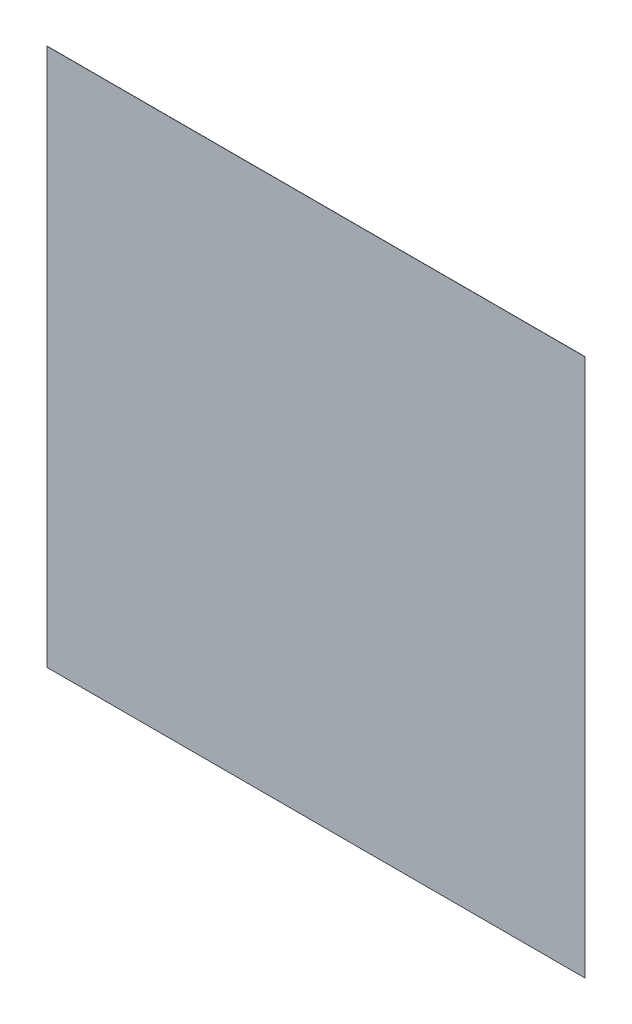
ISO-10303-21;
HEADER;
FILE_DESCRIPTION(('STEP AP214'),'2;1');
FILE_NAME('part.step','',(''),(''),'','','');
FILE_SCHEMA(('AUTOMOTIVE_DESIGN { 1 0 10303 214 1 1 1 1 }'));
ENDSEC;
DATA;
#1=APPLICATION_CONTEXT('core data for automotive mechanical design processes');
#2=APPLICATION_PROTOCOL_DEFINITION('international standard','automotive_design',2000,#1);
#3=PRODUCT_CONTEXT('',#1,'mechanical');
#4=PRODUCT('Part','Part','',(#3));
#5=PRODUCT_RELATED_PRODUCT_CATEGORY('part','',(#4));
#6=PRODUCT_DEFINITION_FORMATION('','',#4);
#7=PRODUCT_DEFINITION_CONTEXT('part definition',#1,'design');
#8=PRODUCT_DEFINITION('design','',#6,#7);
#9=PRODUCT_DEFINITION_SHAPE('','',#8);
#10=(LENGTH_UNIT() NAMED_UNIT(*) SI_UNIT(.MILLI.,.METRE.));
#11=(NAMED_UNIT(*) PLANE_ANGLE_UNIT() SI_UNIT($,.RADIAN.));
#12=(NAMED_UNIT(*) SI_UNIT($,.STERADIAN.) SOLID_ANGLE_UNIT());
#13=UNCERTAINTY_MEASURE_WITH_UNIT(LENGTH_MEASURE(1.E-05),#10,'distance_accuracy_value','');
#14=(GEOMETRIC_REPRESENTATION_CONTEXT(3) GLOBAL_UNCERTAINTY_ASSIGNED_CONTEXT((#13)) GLOBAL_UNIT_ASSIGNED_CONTEXT((#10,
#11,#12)) REPRESENTATION_CONTEXT('',''));
#15=CARTESIAN_POINT('',(0.,0.,0.));
#16=DIRECTION('',(0.,0.,1.));
#17=DIRECTION('',(1.,0.,0.));
#18=AXIS2_PLACEMENT_3D('',#15,#16,#17);
#19=CARTESIAN_POINT('',(-152.4,152.4,-0.1));
#20=DIRECTION('',(-1.,0.,0.));
#21=DIRECTION('',(0.,0.,1.));
#22=AXIS2_PLACEMENT_3D('',#19,#20,#21);
#23=PLANE('',#22);
#24=DIRECTION('',(0.,-1.,0.));
#25=VECTOR('',#24,1.);
#26=CARTESIAN_POINT('',(-152.4,152.4,0.));
#27=LINE('',#26,#25);
#28=CARTESIAN_POINT('',(-152.4,152.4,0.));
#29=VERTEX_POINT('',#28);
#30=CARTESIAN_POINT('',(-152.4,-152.4,0.));
#31=VERTEX_POINT('',#30);
#32=EDGE_CURVE('E95',#29,#31,#27,.T.);
#33=ORIENTED_EDGE('',*,*,#32,.F.);
#34=DIRECTION('',(0.,0.,1.));
#35=VECTOR('',#34,1.);
#36=CARTESIAN_POINT('',(-152.4,152.4,-0.1));
#37=LINE('',#36,#35);
#38=CARTESIAN_POINT('',(-152.4,152.4,-0.1));
#39=VERTEX_POINT('',#38);
#40=EDGE_CURVE('E11',#39,#29,#37,.T.);
#41=ORIENTED_EDGE('',*,*,#40,.F.);
#42=DIRECTION('',(0.,-1.,0.));
#43=VECTOR('',#42,1.);
#44=CARTESIAN_POINT('',(-152.4,152.4,-0.1));
#45=LINE('',#44,#43);
#46=CARTESIAN_POINT('',(-152.4,-152.4,-0.1));
#47=VERTEX_POINT('',#46);
#48=EDGE_CURVE('E89',#39,#47,#45,.T.);
#49=ORIENTED_EDGE('',*,*,#48,.T.);
#50=DIRECTION('',(0.,0.,1.));
#51=VECTOR('',#50,1.);
#52=CARTESIAN_POINT('',(-152.4,-152.4,-0.1));
#53=LINE('',#52,#51);
#54=EDGE_CURVE('E34',#47,#31,#53,.T.);
#55=ORIENTED_EDGE('',*,*,#54,.T.);
#56=EDGE_LOOP('',(#33,#41,#49,#55));
#57=FACE_BOUND('',#56,.T.);
#58=ADVANCED_FACE('F31',(#57),#23,.T.);
#59=CARTESIAN_POINT('',(-152.4,152.4,-0.1));
#60=DIRECTION('',(0.,1.,0.));
#61=DIRECTION('',(-1.,0.,0.));
#62=AXIS2_PLACEMENT_3D('',#59,#60,#61);
#63=PLANE('',#62);
#64=DIRECTION('',(-1.,0.,0.));
#65=VECTOR('',#64,1.);
#66=CARTESIAN_POINT('',(-152.4,152.4,0.));
#67=LINE('',#66,#65);
#68=CARTESIAN_POINT('',(152.4,152.4,0.));
#69=VERTEX_POINT('',#68);
#70=EDGE_CURVE('E91',#69,#29,#67,.T.);
#71=ORIENTED_EDGE('',*,*,#70,.F.);
#72=DIRECTION('',(0.,0.,1.));
#73=VECTOR('',#72,1.);
#74=CARTESIAN_POINT('',(152.4,152.4,-0.1));
#75=LINE('',#74,#73);
#76=CARTESIAN_POINT('',(152.4,152.4,-0.1));
#77=VERTEX_POINT('',#76);
#78=EDGE_CURVE('E40',#77,#69,#75,.T.);
#79=ORIENTED_EDGE('',*,*,#78,.F.);
#80=DIRECTION('',(-1.,0.,0.));
#81=VECTOR('',#80,1.);
#82=CARTESIAN_POINT('',(-152.4,152.4,-0.1));
#83=LINE('',#82,#81);
#84=EDGE_CURVE('E86',#77,#39,#83,.T.);
#85=ORIENTED_EDGE('',*,*,#84,.T.);
#86=ORIENTED_EDGE('',*,*,#40,.T.);
#87=EDGE_LOOP('',(#71,#79,#85,#86));
#88=FACE_BOUND('',#87,.T.);
#89=ADVANCED_FACE('F105',(#88),#63,.T.);
#90=CARTESIAN_POINT('',(152.4,152.4,-0.1));
#91=DIRECTION('',(1.,0.,0.));
#92=DIRECTION('',(0.,0.,-1.));
#93=AXIS2_PLACEMENT_3D('',#90,#91,#92);
#94=PLANE('',#93);
#95=DIRECTION('',(0.,1.,0.));
#96=VECTOR('',#95,1.);
#97=CARTESIAN_POINT('',(152.4,152.4,0.));
#98=LINE('',#97,#96);
#99=CARTESIAN_POINT('',(152.4,-152.4,0.));
#100=VERTEX_POINT('',#99);
#101=EDGE_CURVE('E81',#100,#69,#98,.T.);
#102=ORIENTED_EDGE('',*,*,#101,.F.);
#103=DIRECTION('',(0.,0.,1.));
#104=VECTOR('',#103,1.);
#105=CARTESIAN_POINT('',(152.4,-152.4,-0.1));
#106=LINE('',#105,#104);
#107=CARTESIAN_POINT('',(152.4,-152.4,-0.1));
#108=VERTEX_POINT('',#107);
#109=EDGE_CURVE('E76',#108,#100,#106,.T.);
#110=ORIENTED_EDGE('',*,*,#109,.F.);
#111=DIRECTION('',(0.,1.,0.));
#112=VECTOR('',#111,1.);
#113=CARTESIAN_POINT('',(152.4,152.4,-0.1));
#114=LINE('',#113,#112);
#115=EDGE_CURVE('E79',#108,#77,#114,.T.);
#116=ORIENTED_EDGE('',*,*,#115,.T.);
#117=ORIENTED_EDGE('',*,*,#78,.T.);
#118=EDGE_LOOP('',(#102,#110,#116,#117));
#119=FACE_BOUND('',#118,.T.);
#120=ADVANCED_FACE('F78',(#119),#94,.T.);
#121=CARTESIAN_POINT('',(-152.4,-152.4,-0.1));
#122=DIRECTION('',(0.,-1.,0.));
#123=DIRECTION('',(0.,0.,-1.));
#124=AXIS2_PLACEMENT_3D('',#121,#122,#123);
#125=PLANE('',#124);
#126=DIRECTION('',(1.,0.,0.));
#127=VECTOR('',#126,1.);
#128=CARTESIAN_POINT('',(-152.4,-152.4,0.));
#129=LINE('',#128,#127);
#130=EDGE_CURVE('E98',#31,#100,#129,.T.);
#131=ORIENTED_EDGE('',*,*,#130,.F.);
#132=ORIENTED_EDGE('',*,*,#54,.F.);
#133=DIRECTION('',(1.,0.,0.));
#134=VECTOR('',#133,1.);
#135=CARTESIAN_POINT('',(-152.4,-152.4,-0.1));
#136=LINE('',#135,#134);
#137=EDGE_CURVE('E85',#47,#108,#136,.T.);
#138=ORIENTED_EDGE('',*,*,#137,.T.);
#139=ORIENTED_EDGE('',*,*,#109,.T.);
#140=EDGE_LOOP('',(#131,#132,#138,#139));
#141=FACE_BOUND('',#140,.T.);
#142=ADVANCED_FACE('F88',(#141),#125,.T.);
#143=CARTESIAN_POINT('',(-152.4,-152.4,-0.1));
#144=DIRECTION('',(0.,0.,1.));
#145=DIRECTION('',(1.,0.,0.));
#146=AXIS2_PLACEMENT_3D('',#143,#144,#145);
#147=PLANE('',#146);
#148=ORIENTED_EDGE('',*,*,#48,.F.);
#149=ORIENTED_EDGE('',*,*,#84,.F.);
#150=ORIENTED_EDGE('',*,*,#115,.F.);
#151=ORIENTED_EDGE('',*,*,#137,.F.);
#152=EDGE_LOOP('',(#148,#149,#150,#151));
#153=FACE_BOUND('',#152,.T.);
#154=ADVANCED_FACE('F84',(#153),#147,.F.);
#155=CARTESIAN_POINT('',(-152.4,-152.4,0.));
#156=DIRECTION('',(0.,0.,1.));
#157=DIRECTION('',(1.,0.,0.));
#158=AXIS2_PLACEMENT_3D('',#155,#156,#157);
#159=PLANE('',#158);
#160=ORIENTED_EDGE('',*,*,#32,.T.);
#161=ORIENTED_EDGE('',*,*,#130,.T.);
#162=ORIENTED_EDGE('',*,*,#101,.T.);
#163=ORIENTED_EDGE('',*,*,#70,.T.);
#164=EDGE_LOOP('',(#160,#161,#162,#163));
#165=FACE_BOUND('',#164,.T.);
#166=ADVANCED_FACE('F104',(#165),#159,.T.);
#167=CLOSED_SHELL('',(#58,#89,#120,#142,#154,#166));
#168=MANIFOLD_SOLID_BREP('B2',#167);
#169=ADVANCED_BREP_SHAPE_REPRESENTATION('',(#18,#168),#14);
#170=SHAPE_DEFINITION_REPRESENTATION(#9,#169);
ENDSEC;
END-ISO-10303-21;
